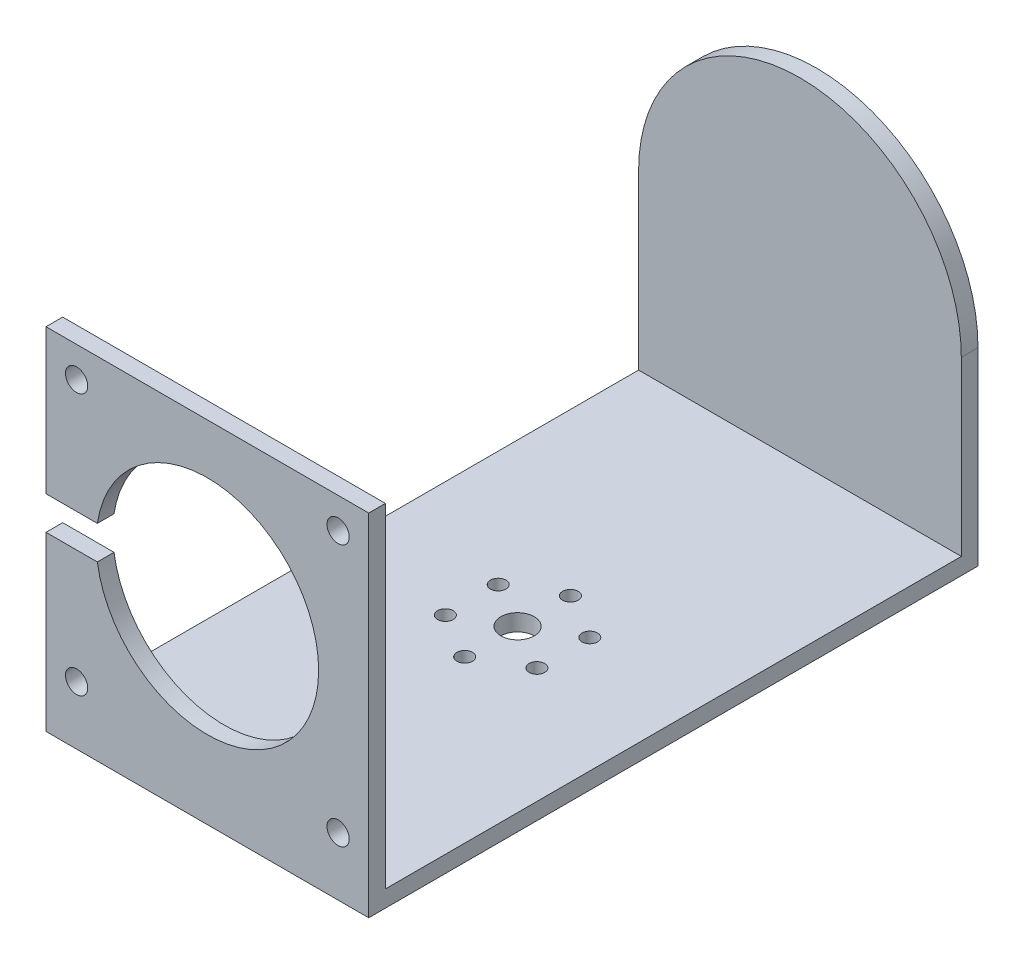
ISO-10303-21;
HEADER;
FILE_DESCRIPTION(('STEP AP214'),'2;1');
FILE_NAME('part.step','',(''),(''),'','','');
FILE_SCHEMA(('AUTOMOTIVE_DESIGN { 1 0 10303 214 1 1 1 1 }'));
ENDSEC;
DATA;
#1=APPLICATION_CONTEXT('core data for automotive mechanical design processes');
#2=APPLICATION_PROTOCOL_DEFINITION('international standard','automotive_design',2000,#1);
#3=PRODUCT_CONTEXT('',#1,'mechanical');
#4=PRODUCT('Part','Part','',(#3));
#5=PRODUCT_RELATED_PRODUCT_CATEGORY('part','',(#4));
#6=PRODUCT_DEFINITION_FORMATION('','',#4);
#7=PRODUCT_DEFINITION_CONTEXT('part definition',#1,'design');
#8=PRODUCT_DEFINITION('design','',#6,#7);
#9=PRODUCT_DEFINITION_SHAPE('','',#8);
#10=(LENGTH_UNIT() NAMED_UNIT(*) SI_UNIT(.MILLI.,.METRE.));
#11=(NAMED_UNIT(*) PLANE_ANGLE_UNIT() SI_UNIT($,.RADIAN.));
#12=(NAMED_UNIT(*) SI_UNIT($,.STERADIAN.) SOLID_ANGLE_UNIT());
#13=UNCERTAINTY_MEASURE_WITH_UNIT(LENGTH_MEASURE(1.E-05),#10,'distance_accuracy_value','');
#14=(GEOMETRIC_REPRESENTATION_CONTEXT(3) GLOBAL_UNCERTAINTY_ASSIGNED_CONTEXT((#13)) GLOBAL_UNIT_ASSIGNED_CONTEXT((#10,
#11,#12)) REPRESENTATION_CONTEXT('',''));
#15=CARTESIAN_POINT('',(0.,0.,0.));
#16=DIRECTION('',(0.,0.,1.));
#17=DIRECTION('',(1.,0.,0.));
#18=AXIS2_PLACEMENT_3D('',#15,#16,#17);
#19=CARTESIAN_POINT('',(0.,0.,0.));
#20=DIRECTION('',(-1.,0.,0.));
#21=DIRECTION('',(0.,0.,1.));
#22=AXIS2_PLACEMENT_3D('',#19,#20,#21);
#23=PLANE('',#22);
#24=DIRECTION('',(0.,0.,1.));
#25=VECTOR('',#24,1.);
#26=CARTESIAN_POINT('',(0.,-1.59919038462656,66.3516718826573));
#27=LINE('',#26,#25);
#28=CARTESIAN_POINT('',(0.,-1.59919038462656,73.3516718826573));
#29=VERTEX_POINT('',#28);
#30=CARTESIAN_POINT('',(0.,-1.59919038462656,76.3516718826573));
#31=VERTEX_POINT('',#30);
#32=EDGE_CURVE('E138',#29,#31,#27,.T.);
#33=ORIENTED_EDGE('',*,*,#32,.F.);
#34=DIRECTION('',(0.,1.,0.));
#35=VECTOR('',#34,1.);
#36=CARTESIAN_POINT('',(0.,30.4008096153734,73.3516718826573));
#37=LINE('',#36,#35);
#38=CARTESIAN_POINT('',(0.,-29.5991903846266,73.3516718826573));
#39=VERTEX_POINT('',#38);
#40=EDGE_CURVE('E159',#39,#29,#37,.T.);
#41=ORIENTED_EDGE('',*,*,#40,.F.);
#42=DIRECTION('',(0.,0.,1.));
#43=VECTOR('',#42,1.);
#44=CARTESIAN_POINT('',(0.,-29.5991903846266,73.3516718826573));
#45=LINE('',#44,#43);
#46=CARTESIAN_POINT('',(0.,-29.5991903846266,-30.1483281173427));
#47=VERTEX_POINT('',#46);
#48=EDGE_CURVE('E157',#47,#39,#45,.T.);
#49=ORIENTED_EDGE('',*,*,#48,.F.);
#50=DIRECTION('',(0.,-1.,0.));
#51=VECTOR('',#50,1.);
#52=CARTESIAN_POINT('',(0.,-29.5991903846266,-30.1483281173427));
#53=LINE('',#52,#51);
#54=CARTESIAN_POINT('',(0.,1.40080961537344,-30.1483281173427));
#55=VERTEX_POINT('',#54);
#56=EDGE_CURVE('E155',#55,#47,#53,.T.);
#57=ORIENTED_EDGE('',*,*,#56,.F.);
#58=DIRECTION('',(0.,0.,-1.));
#59=VECTOR('',#58,1.);
#60=CARTESIAN_POINT('',(0.,1.40080961537344,24.8516718826573));
#61=LINE('',#60,#59);
#62=CARTESIAN_POINT('',(0.,1.40080961537344,-33.1483281173427));
#63=VERTEX_POINT('',#62);
#64=EDGE_CURVE('E203',#63,#55,#61,.F.);
#65=ORIENTED_EDGE('',*,*,#64,.F.);
#66=DIRECTION('',(0.,1.,0.));
#67=VECTOR('',#66,1.);
#68=CARTESIAN_POINT('',(0.,30.4008096153734,-33.1483281173427));
#69=LINE('',#68,#67);
#70=CARTESIAN_POINT('',(0.,-32.5991903846266,-33.1483281173427));
#71=VERTEX_POINT('',#70);
#72=EDGE_CURVE('E147',#71,#63,#69,.T.);
#73=ORIENTED_EDGE('',*,*,#72,.F.);
#74=DIRECTION('',(0.,0.,-1.));
#75=VECTOR('',#74,1.);
#76=CARTESIAN_POINT('',(0.,-32.5991903846266,-33.1483281173427));
#77=LINE('',#76,#75);
#78=CARTESIAN_POINT('',(0.,-32.5991903846266,76.3516718826573));
#79=VERTEX_POINT('',#78);
#80=EDGE_CURVE('E144',#79,#71,#77,.T.);
#81=ORIENTED_EDGE('',*,*,#80,.F.);
#82=DIRECTION('',(0.,-1.,0.));
#83=VECTOR('',#82,1.);
#84=CARTESIAN_POINT('',(0.,-32.5991903846266,76.3516718826573));
#85=LINE('',#84,#83);
#86=EDGE_CURVE('E145',#31,#79,#85,.T.);
#87=ORIENTED_EDGE('',*,*,#86,.F.);
#88=EDGE_LOOP('',(#33,#41,#49,#57,#65,#73,#81,#87));
#89=FACE_BOUND('',#88,.T.);
#90=ADVANCED_FACE('F36',(#89),#23,.T.);
#91=CARTESIAN_POINT('',(58.,30.4008096153734,-33.1483281173427));
#92=DIRECTION('',(0.,0.,1.));
#93=DIRECTION('',(1.,0.,0.));
#94=AXIS2_PLACEMENT_3D('',#91,#92,#93);
#95=PLANE('',#94);
#96=ORIENTED_EDGE('',*,*,#72,.T.);
#97=CARTESIAN_POINT('',(29.,1.40080961537344,-33.1483281173427));
#98=DIRECTION('',(0.,0.,1.));
#99=DIRECTION('',(1.,0.,0.));
#100=AXIS2_PLACEMENT_3D('',#97,#98,#99);
#101=CIRCLE('',#100,29.);
#102=CARTESIAN_POINT('',(58.,1.40080961537344,-33.1483281173427));
#103=VERTEX_POINT('',#102);
#104=EDGE_CURVE('E266',#103,#63,#101,.T.);
#105=ORIENTED_EDGE('',*,*,#104,.F.);
#106=DIRECTION('',(0.,1.,0.));
#107=VECTOR('',#106,1.);
#108=CARTESIAN_POINT('',(58.,30.4008096153734,-33.1483281173427));
#109=LINE('',#108,#107);
#110=CARTESIAN_POINT('',(58.,-32.5991903846266,-33.1483281173427));
#111=VERTEX_POINT('',#110);
#112=EDGE_CURVE('E285',#111,#103,#109,.T.);
#113=ORIENTED_EDGE('',*,*,#112,.F.);
#114=DIRECTION('',(-1.,0.,0.));
#115=VECTOR('',#114,1.);
#116=CARTESIAN_POINT('',(58.,-32.5991903846266,-33.1483281173427));
#117=LINE('',#116,#115);
#118=EDGE_CURVE('E173',#111,#71,#117,.T.);
#119=ORIENTED_EDGE('',*,*,#118,.T.);
#120=EDGE_LOOP('',(#96,#105,#113,#119));
#121=FACE_BOUND('',#120,.T.);
#122=CARTESIAN_POINT('',(29.,1.40080961537344,-33.1483281173427));
#123=DIRECTION('',(0.,0.,1.));
#124=DIRECTION('',(1.,0.,0.));
#125=AXIS2_PLACEMENT_3D('',#122,#123,#124);
#126=CIRCLE('',#125,2.95);
#127=CARTESIAN_POINT('',(31.95,1.40080961537344,-33.1483281173427));
#128=VERTEX_POINT('',#127);
#129=EDGE_CURVE('E206',#128,#128,#126,.F.);
#130=ORIENTED_EDGE('',*,*,#129,.F.);
#131=EDGE_LOOP('',(#130));
#132=FACE_BOUND('',#131,.T.);
#133=ADVANCED_FACE('F300',(#121,#132),#95,.F.);
#134=CARTESIAN_POINT('',(58.,30.4008096153734,76.3516718826573));
#135=DIRECTION('',(0.,-1.,0.));
#136=DIRECTION('',(0.,0.,-1.));
#137=AXIS2_PLACEMENT_3D('',#134,#135,#136);
#138=PLANE('',#137);
#139=DIRECTION('',(0.,0.,1.));
#140=VECTOR('',#139,1.);
#141=CARTESIAN_POINT('',(0.,30.4008096153734,76.3516718826573));
#142=LINE('',#141,#140);
#143=CARTESIAN_POINT('',(0.,30.4008096153734,73.3516718826573));
#144=VERTEX_POINT('',#143);
#145=CARTESIAN_POINT('',(0.,30.4008096153734,76.3516718826573));
#146=VERTEX_POINT('',#145);
#147=EDGE_CURVE('E149',#144,#146,#142,.T.);
#148=ORIENTED_EDGE('',*,*,#147,.T.);
#149=DIRECTION('',(-1.,0.,0.));
#150=VECTOR('',#149,1.);
#151=CARTESIAN_POINT('',(58.,30.4008096153734,76.3516718826573));
#152=LINE('',#151,#150);
#153=CARTESIAN_POINT('',(58.,30.4008096153734,76.3516718826573));
#154=VERTEX_POINT('',#153);
#155=EDGE_CURVE('E142',#154,#146,#152,.T.);
#156=ORIENTED_EDGE('',*,*,#155,.F.);
#157=DIRECTION('',(0.,0.,1.));
#158=VECTOR('',#157,1.);
#159=CARTESIAN_POINT('',(58.,30.4008096153734,76.3516718826573));
#160=LINE('',#159,#158);
#161=CARTESIAN_POINT('',(58.,30.4008096153734,73.3516718826573));
#162=VERTEX_POINT('',#161);
#163=EDGE_CURVE('E162',#162,#154,#160,.T.);
#164=ORIENTED_EDGE('',*,*,#163,.F.);
#165=DIRECTION('',(-1.,0.,0.));
#166=VECTOR('',#165,1.);
#167=CARTESIAN_POINT('',(58.,30.4008096153734,73.3516718826573));
#168=LINE('',#167,#166);
#169=EDGE_CURVE('E163',#162,#144,#168,.T.);
#170=ORIENTED_EDGE('',*,*,#169,.T.);
#171=EDGE_LOOP('',(#148,#156,#164,#170));
#172=FACE_BOUND('',#171,.T.);
#173=ADVANCED_FACE('F38',(#172),#138,.F.);
#174=CARTESIAN_POINT('',(58.,-32.5991903846266,76.3516718826573));
#175=DIRECTION('',(0.,0.,-1.));
#176=DIRECTION('',(-1.,0.,0.));
#177=AXIS2_PLACEMENT_3D('',#174,#175,#176);
#178=PLANE('',#177);
#179=CARTESIAN_POINT('',(5.50000000000003,-22.0991903846266,76.3516718826573));
#180=DIRECTION('',(0.,0.,1.));
#181=DIRECTION('',(-1.,0.,0.));
#182=AXIS2_PLACEMENT_3D('',#179,#180,#181);
#183=CIRCLE('',#182,2.);
#184=CARTESIAN_POINT('',(3.50000000000003,-22.0991903846266,76.3516718826573));
#185=VERTEX_POINT('',#184);
#186=EDGE_CURVE('E196',#185,#185,#183,.T.);
#187=ORIENTED_EDGE('',*,*,#186,.F.);
#188=EDGE_LOOP('',(#187));
#189=FACE_BOUND('',#188,.T.);
#190=CARTESIAN_POINT('',(52.5,-22.0991903846266,76.3516718826573));
#191=DIRECTION('',(0.,0.,1.));
#192=DIRECTION('',(1.,0.,0.));
#193=AXIS2_PLACEMENT_3D('',#190,#191,#192);
#194=CIRCLE('',#193,2.);
#195=CARTESIAN_POINT('',(54.5,-22.0991903846266,76.3516718826573));
#196=VERTEX_POINT('',#195);
#197=EDGE_CURVE('E192',#196,#196,#194,.T.);
#198=ORIENTED_EDGE('',*,*,#197,.F.);
#199=EDGE_LOOP('',(#198));
#200=FACE_BOUND('',#199,.T.);
#201=CARTESIAN_POINT('',(52.5,24.9008096153734,76.3516718826573));
#202=DIRECTION('',(0.,0.,1.));
#203=DIRECTION('',(-1.,0.,0.));
#204=AXIS2_PLACEMENT_3D('',#201,#202,#203);
#205=CIRCLE('',#204,2.);
#206=CARTESIAN_POINT('',(50.5,24.9008096153734,76.3516718826573));
#207=VERTEX_POINT('',#206);
#208=EDGE_CURVE('E188',#207,#207,#205,.T.);
#209=ORIENTED_EDGE('',*,*,#208,.F.);
#210=EDGE_LOOP('',(#209));
#211=FACE_BOUND('',#210,.T.);
#212=CARTESIAN_POINT('',(5.5,24.9008096153734,76.3516718826573));
#213=DIRECTION('',(0.,0.,1.));
#214=DIRECTION('',(1.,0.,0.));
#215=AXIS2_PLACEMENT_3D('',#212,#213,#214);
#216=CIRCLE('',#215,2.);
#217=CARTESIAN_POINT('',(7.5,24.9008096153734,76.3516718826573));
#218=VERTEX_POINT('',#217);
#219=EDGE_CURVE('E184',#218,#218,#216,.T.);
#220=ORIENTED_EDGE('',*,*,#219,.F.);
#221=EDGE_LOOP('',(#220));
#222=FACE_BOUND('',#221,.T.);
#223=CARTESIAN_POINT('',(29.,1.40080961537344,76.3516718826573));
#224=DIRECTION('',(0.,0.,1.));
#225=DIRECTION('',(1.,0.,0.));
#226=AXIS2_PLACEMENT_3D('',#223,#224,#225);
#227=CIRCLE('',#226,20.);
#228=CARTESIAN_POINT('',(9.22628006671481,-1.59919038462656,76.3516718826573));
#229=VERTEX_POINT('',#228);
#230=CARTESIAN_POINT('',(9.22628006671481,4.40080961537344,76.3516718826573));
#231=VERTEX_POINT('',#230);
#232=EDGE_CURVE('E200',#229,#231,#227,.T.);
#233=ORIENTED_EDGE('',*,*,#232,.F.);
#234=DIRECTION('',(1.,0.,0.));
#235=VECTOR('',#234,1.);
#236=CARTESIAN_POINT('',(29.,-1.59919038462656,76.3516718826573));
#237=LINE('',#236,#235);
#238=EDGE_CURVE('E59',#31,#229,#237,.T.);
#239=ORIENTED_EDGE('',*,*,#238,.F.);
#240=ORIENTED_EDGE('',*,*,#86,.T.);
#241=DIRECTION('',(-1.,0.,0.));
#242=VECTOR('',#241,1.);
#243=CARTESIAN_POINT('',(58.,-32.5991903846266,76.3516718826573));
#244=LINE('',#243,#242);
#245=CARTESIAN_POINT('',(58.,-32.5991903846266,76.3516718826573));
#246=VERTEX_POINT('',#245);
#247=EDGE_CURVE('E176',#246,#79,#244,.T.);
#248=ORIENTED_EDGE('',*,*,#247,.F.);
#249=DIRECTION('',(0.,-1.,0.));
#250=VECTOR('',#249,1.);
#251=CARTESIAN_POINT('',(58.,-32.5991903846266,76.3516718826573));
#252=LINE('',#251,#250);
#253=EDGE_CURVE('E281',#154,#246,#252,.T.);
#254=ORIENTED_EDGE('',*,*,#253,.F.);
#255=ORIENTED_EDGE('',*,*,#155,.T.);
#256=CARTESIAN_POINT('',(0.,4.40080961537344,76.3516718826573));
#257=VERTEX_POINT('',#256);
#258=EDGE_CURVE('E135',#146,#257,#85,.T.);
#259=ORIENTED_EDGE('',*,*,#258,.T.);
#260=DIRECTION('',(-1.,0.,0.));
#261=VECTOR('',#260,1.);
#262=CARTESIAN_POINT('',(29.,4.40080961537344,76.3516718826573));
#263=LINE('',#262,#261);
#264=EDGE_CURVE('E122',#231,#257,#263,.T.);
#265=ORIENTED_EDGE('',*,*,#264,.F.);
#266=EDGE_LOOP('',(#233,#239,#240,#248,#254,#255,#259,#265));
#267=FACE_BOUND('',#266,.T.);
#268=ADVANCED_FACE('F140',(#189,#200,#211,#222,#267),#178,.F.);
#269=CARTESIAN_POINT('',(58.,-32.5991903846266,-33.1483281173427));
#270=DIRECTION('',(0.,1.,0.));
#271=DIRECTION('',(0.,0.,1.));
#272=AXIS2_PLACEMENT_3D('',#269,#270,#271);
#273=PLANE('',#272);
#274=CARTESIAN_POINT('',(20.7727586640481,-32.5991903846266,25.3516718826571));
#275=DIRECTION('',(0.,-1.,0.));
#276=DIRECTION('',(0.,0.,-1.));
#277=AXIS2_PLACEMENT_3D('',#274,#275,#276);
#278=CIRCLE('',#277,1.39999999999999);
#279=CARTESIAN_POINT('',(20.7727586640481,-32.5991903846266,23.9516718826571));
#280=VERTEX_POINT('',#279);
#281=EDGE_CURVE('E236',#280,#280,#278,.T.);
#282=ORIENTED_EDGE('',*,*,#281,.F.);
#283=EDGE_LOOP('',(#282));
#284=FACE_BOUND('',#283,.T.);
#285=CARTESIAN_POINT('',(20.7727586640484,-32.5991903846266,15.851671882657));
#286=DIRECTION('',(0.,-1.,0.));
#287=DIRECTION('',(0.,0.,-1.));
#288=AXIS2_PLACEMENT_3D('',#285,#286,#287);
#289=CIRCLE('',#288,1.4);
#290=CARTESIAN_POINT('',(20.7727586640484,-32.5991903846266,14.451671882657));
#291=VERTEX_POINT('',#290);
#292=EDGE_CURVE('E233',#291,#291,#289,.T.);
#293=ORIENTED_EDGE('',*,*,#292,.F.);
#294=EDGE_LOOP('',(#293));
#295=FACE_BOUND('',#294,.T.);
#296=CARTESIAN_POINT('',(29.0000000000007,-32.5991903846266,11.1016718826573));
#297=DIRECTION('',(0.,-1.,0.));
#298=DIRECTION('',(0.,0.,-1.));
#299=AXIS2_PLACEMENT_3D('',#296,#297,#298);
#300=CIRCLE('',#299,1.4);
#301=CARTESIAN_POINT('',(29.0000000000007,-32.5991903846266,9.70167188265729));
#302=VERTEX_POINT('',#301);
#303=EDGE_CURVE('E229',#302,#302,#300,.T.);
#304=ORIENTED_EDGE('',*,*,#303,.F.);
#305=EDGE_LOOP('',(#304));
#306=FACE_BOUND('',#305,.T.);
#307=CARTESIAN_POINT('',(37.2272413359527,-32.5991903846266,15.8516718826576));
#308=DIRECTION('',(0.,-1.,0.));
#309=DIRECTION('',(0.,0.,-1.));
#310=AXIS2_PLACEMENT_3D('',#307,#308,#309);
#311=CIRCLE('',#310,1.40000000000001);
#312=CARTESIAN_POINT('',(37.2272413359527,-32.5991903846266,14.4516718826576));
#313=VERTEX_POINT('',#312);
#314=EDGE_CURVE('E225',#313,#313,#311,.T.);
#315=ORIENTED_EDGE('',*,*,#314,.F.);
#316=EDGE_LOOP('',(#315));
#317=FACE_BOUND('',#316,.T.);
#318=CARTESIAN_POINT('',(37.2272413359524,-32.5991903846266,25.3516718826576));
#319=DIRECTION('',(0.,-1.,0.));
#320=DIRECTION('',(0.,0.,-1.));
#321=AXIS2_PLACEMENT_3D('',#318,#319,#320);
#322=CIRCLE('',#321,1.4);
#323=CARTESIAN_POINT('',(37.2272413359524,-32.5991903846266,23.9516718826576));
#324=VERTEX_POINT('',#323);
#325=EDGE_CURVE('E221',#324,#324,#322,.T.);
#326=ORIENTED_EDGE('',*,*,#325,.F.);
#327=EDGE_LOOP('',(#326));
#328=FACE_BOUND('',#327,.T.);
#329=CARTESIAN_POINT('',(29.,-32.5991903846266,30.1016718826573));
#330=DIRECTION('',(0.,-1.,0.));
#331=DIRECTION('',(0.,0.,-1.));
#332=AXIS2_PLACEMENT_3D('',#329,#330,#331);
#333=CIRCLE('',#332,1.4);
#334=CARTESIAN_POINT('',(29.,-32.5991903846266,28.7016718826573));
#335=VERTEX_POINT('',#334);
#336=EDGE_CURVE('E217',#335,#335,#333,.T.);
#337=ORIENTED_EDGE('',*,*,#336,.F.);
#338=EDGE_LOOP('',(#337));
#339=FACE_BOUND('',#338,.T.);
#340=CARTESIAN_POINT('',(29.,-32.5991903846266,20.6016718826573));
#341=DIRECTION('',(0.,-1.,0.));
#342=DIRECTION('',(0.,0.,-1.));
#343=AXIS2_PLACEMENT_3D('',#340,#341,#342);
#344=CIRCLE('',#343,3.);
#345=CARTESIAN_POINT('',(29.,-32.5991903846266,17.6016718826573));
#346=VERTEX_POINT('',#345);
#347=EDGE_CURVE('E213',#346,#346,#344,.T.);
#348=ORIENTED_EDGE('',*,*,#347,.F.);
#349=EDGE_LOOP('',(#348));
#350=FACE_BOUND('',#349,.T.);
#351=ORIENTED_EDGE('',*,*,#80,.T.);
#352=ORIENTED_EDGE('',*,*,#118,.F.);
#353=DIRECTION('',(0.,0.,-1.));
#354=VECTOR('',#353,1.);
#355=CARTESIAN_POINT('',(58.,-32.5991903846266,-33.1483281173427));
#356=LINE('',#355,#354);
#357=EDGE_CURVE('E283',#246,#111,#356,.T.);
#358=ORIENTED_EDGE('',*,*,#357,.F.);
#359=ORIENTED_EDGE('',*,*,#247,.T.);
#360=EDGE_LOOP('',(#351,#352,#358,#359));
#361=FACE_BOUND('',#360,.T.);
#362=ADVANCED_FACE('F305',(#284,#295,#306,#317,#328,#339,#350,#361),#273,.F.);
#363=CARTESIAN_POINT('',(58.,-29.5991903846266,-30.1483281173427));
#364=DIRECTION('',(0.,0.,-1.));
#365=DIRECTION('',(-1.,0.,0.));
#366=AXIS2_PLACEMENT_3D('',#363,#364,#365);
#367=PLANE('',#366);
#368=CARTESIAN_POINT('',(29.,1.40080961537344,-30.1483281173427));
#369=DIRECTION('',(0.,0.,-1.));
#370=DIRECTION('',(-1.,0.,0.));
#371=AXIS2_PLACEMENT_3D('',#368,#369,#370);
#372=CIRCLE('',#371,29.);
#373=CARTESIAN_POINT('',(58.,1.40080961537344,-30.1483281173427));
#374=VERTEX_POINT('',#373);
#375=EDGE_CURVE('E268',#374,#55,#372,.F.);
#376=ORIENTED_EDGE('',*,*,#375,.T.);
#377=ORIENTED_EDGE('',*,*,#56,.T.);
#378=DIRECTION('',(-1.,0.,0.));
#379=VECTOR('',#378,1.);
#380=CARTESIAN_POINT('',(58.,-29.5991903846266,-30.1483281173427));
#381=LINE('',#380,#379);
#382=CARTESIAN_POINT('',(58.,-29.5991903846266,-30.1483281173427));
#383=VERTEX_POINT('',#382);
#384=EDGE_CURVE('E170',#383,#47,#381,.T.);
#385=ORIENTED_EDGE('',*,*,#384,.F.);
#386=DIRECTION('',(0.,-1.,0.));
#387=VECTOR('',#386,1.);
#388=CARTESIAN_POINT('',(58.,-29.5991903846266,-30.1483281173427));
#389=LINE('',#388,#387);
#390=EDGE_CURVE('E288',#374,#383,#389,.T.);
#391=ORIENTED_EDGE('',*,*,#390,.F.);
#392=EDGE_LOOP('',(#376,#377,#385,#391));
#393=FACE_BOUND('',#392,.T.);
#394=ADVANCED_FACE('F405',(#393),#367,.F.);
#395=CARTESIAN_POINT('',(58.,-29.5991903846266,73.3516718826573));
#396=DIRECTION('',(0.,-1.,0.));
#397=DIRECTION('',(0.,0.,-1.));
#398=AXIS2_PLACEMENT_3D('',#395,#396,#397);
#399=PLANE('',#398);
#400=CARTESIAN_POINT('',(20.7727586640481,-29.5991903846266,25.3516718826571));
#401=DIRECTION('',(0.,-1.,0.));
#402=DIRECTION('',(0.,0.,-1.));
#403=AXIS2_PLACEMENT_3D('',#400,#401,#402);
#404=CIRCLE('',#403,1.39999999999999);
#405=CARTESIAN_POINT('',(20.7727586640481,-29.5991903846266,23.9516718826571));
#406=VERTEX_POINT('',#405);
#407=EDGE_CURVE('E234',#406,#406,#404,.T.);
#408=ORIENTED_EDGE('',*,*,#407,.T.);
#409=EDGE_LOOP('',(#408));
#410=FACE_BOUND('',#409,.T.);
#411=CARTESIAN_POINT('',(20.7727586640484,-29.5991903846266,15.851671882657));
#412=DIRECTION('',(0.,-1.,0.));
#413=DIRECTION('',(0.,0.,-1.));
#414=AXIS2_PLACEMENT_3D('',#411,#412,#413);
#415=CIRCLE('',#414,1.4);
#416=CARTESIAN_POINT('',(20.7727586640484,-29.5991903846266,14.451671882657));
#417=VERTEX_POINT('',#416);
#418=EDGE_CURVE('E230',#417,#417,#415,.T.);
#419=ORIENTED_EDGE('',*,*,#418,.T.);
#420=EDGE_LOOP('',(#419));
#421=FACE_BOUND('',#420,.T.);
#422=CARTESIAN_POINT('',(29.0000000000007,-29.5991903846266,11.1016718826573));
#423=DIRECTION('',(0.,-1.,0.));
#424=DIRECTION('',(0.,0.,-1.));
#425=AXIS2_PLACEMENT_3D('',#422,#423,#424);
#426=CIRCLE('',#425,1.4);
#427=CARTESIAN_POINT('',(29.0000000000007,-29.5991903846266,9.70167188265729));
#428=VERTEX_POINT('',#427);
#429=EDGE_CURVE('E226',#428,#428,#426,.T.);
#430=ORIENTED_EDGE('',*,*,#429,.T.);
#431=EDGE_LOOP('',(#430));
#432=FACE_BOUND('',#431,.T.);
#433=CARTESIAN_POINT('',(37.2272413359527,-29.5991903846266,15.8516718826576));
#434=DIRECTION('',(0.,-1.,0.));
#435=DIRECTION('',(0.,0.,-1.));
#436=AXIS2_PLACEMENT_3D('',#433,#434,#435);
#437=CIRCLE('',#436,1.40000000000001);
#438=CARTESIAN_POINT('',(37.2272413359527,-29.5991903846266,14.4516718826576));
#439=VERTEX_POINT('',#438);
#440=EDGE_CURVE('E222',#439,#439,#437,.T.);
#441=ORIENTED_EDGE('',*,*,#440,.T.);
#442=EDGE_LOOP('',(#441));
#443=FACE_BOUND('',#442,.T.);
#444=CARTESIAN_POINT('',(37.2272413359524,-29.5991903846266,25.3516718826576));
#445=DIRECTION('',(0.,-1.,0.));
#446=DIRECTION('',(0.,0.,-1.));
#447=AXIS2_PLACEMENT_3D('',#444,#445,#446);
#448=CIRCLE('',#447,1.4);
#449=CARTESIAN_POINT('',(37.2272413359524,-29.5991903846266,23.9516718826576));
#450=VERTEX_POINT('',#449);
#451=EDGE_CURVE('E218',#450,#450,#448,.T.);
#452=ORIENTED_EDGE('',*,*,#451,.T.);
#453=EDGE_LOOP('',(#452));
#454=FACE_BOUND('',#453,.T.);
#455=CARTESIAN_POINT('',(29.,-29.5991903846266,30.1016718826573));
#456=DIRECTION('',(0.,-1.,0.));
#457=DIRECTION('',(0.,0.,-1.));
#458=AXIS2_PLACEMENT_3D('',#455,#456,#457);
#459=CIRCLE('',#458,1.4);
#460=CARTESIAN_POINT('',(29.,-29.5991903846266,28.7016718826573));
#461=VERTEX_POINT('',#460);
#462=EDGE_CURVE('E214',#461,#461,#459,.T.);
#463=ORIENTED_EDGE('',*,*,#462,.T.);
#464=EDGE_LOOP('',(#463));
#465=FACE_BOUND('',#464,.T.);
#466=CARTESIAN_POINT('',(29.,-29.5991903846266,20.6016718826573));
#467=DIRECTION('',(0.,-1.,0.));
#468=DIRECTION('',(0.,0.,-1.));
#469=AXIS2_PLACEMENT_3D('',#466,#467,#468);
#470=CIRCLE('',#469,3.);
#471=CARTESIAN_POINT('',(29.,-29.5991903846266,17.6016718826573));
#472=VERTEX_POINT('',#471);
#473=EDGE_CURVE('E209',#472,#472,#470,.T.);
#474=ORIENTED_EDGE('',*,*,#473,.T.);
#475=EDGE_LOOP('',(#474));
#476=FACE_BOUND('',#475,.T.);
#477=ORIENTED_EDGE('',*,*,#48,.T.);
#478=DIRECTION('',(-1.,0.,0.));
#479=VECTOR('',#478,1.);
#480=CARTESIAN_POINT('',(58.,-29.5991903846266,73.3516718826573));
#481=LINE('',#480,#479);
#482=CARTESIAN_POINT('',(58.,-29.5991903846266,73.3516718826573));
#483=VERTEX_POINT('',#482);
#484=EDGE_CURVE('E166',#483,#39,#481,.T.);
#485=ORIENTED_EDGE('',*,*,#484,.F.);
#486=DIRECTION('',(0.,0.,1.));
#487=VECTOR('',#486,1.);
#488=CARTESIAN_POINT('',(58.,-29.5991903846266,73.3516718826573));
#489=LINE('',#488,#487);
#490=EDGE_CURVE('E290',#383,#483,#489,.T.);
#491=ORIENTED_EDGE('',*,*,#490,.F.);
#492=ORIENTED_EDGE('',*,*,#384,.T.);
#493=EDGE_LOOP('',(#477,#485,#491,#492));
#494=FACE_BOUND('',#493,.T.);
#495=ADVANCED_FACE('F328',(#410,#421,#432,#443,#454,#465,#476,#494),#399,.F.);
#496=CARTESIAN_POINT('',(58.,30.4008096153734,73.3516718826573));
#497=DIRECTION('',(0.,0.,1.));
#498=DIRECTION('',(0.,-1.,0.));
#499=AXIS2_PLACEMENT_3D('',#496,#497,#498);
#500=PLANE('',#499);
#501=ORIENTED_EDGE('',*,*,#40,.T.);
#502=DIRECTION('',(1.,0.,0.));
#503=VECTOR('',#502,1.);
#504=CARTESIAN_POINT('',(58.,-1.59919038462656,73.3516718826573));
#505=LINE('',#504,#503);
#506=CARTESIAN_POINT('',(9.22628006671482,-1.59919038462656,73.3516718826573));
#507=VERTEX_POINT('',#506);
#508=EDGE_CURVE('E244',#29,#507,#505,.T.);
#509=ORIENTED_EDGE('',*,*,#508,.T.);
#510=CARTESIAN_POINT('',(29.,1.40080961537344,73.3516718826573));
#511=DIRECTION('',(0.,0.,1.));
#512=DIRECTION('',(0.,-1.,0.));
#513=AXIS2_PLACEMENT_3D('',#510,#511,#512);
#514=CIRCLE('',#513,20.);
#515=CARTESIAN_POINT('',(9.22628006671481,4.40080961537344,73.3516718826573));
#516=VERTEX_POINT('',#515);
#517=EDGE_CURVE('E197',#507,#516,#514,.T.);
#518=ORIENTED_EDGE('',*,*,#517,.T.);
#519=DIRECTION('',(-1.,0.,0.));
#520=VECTOR('',#519,1.);
#521=CARTESIAN_POINT('',(58.,4.40080961537344,73.3516718826573));
#522=LINE('',#521,#520);
#523=CARTESIAN_POINT('',(0.,4.40080961537344,73.3516718826573));
#524=VERTEX_POINT('',#523);
#525=EDGE_CURVE('E51',#516,#524,#522,.T.);
#526=ORIENTED_EDGE('',*,*,#525,.T.);
#527=EDGE_CURVE('E137',#524,#144,#37,.T.);
#528=ORIENTED_EDGE('',*,*,#527,.T.);
#529=ORIENTED_EDGE('',*,*,#169,.F.);
#530=DIRECTION('',(0.,1.,0.));
#531=VECTOR('',#530,1.);
#532=CARTESIAN_POINT('',(58.,30.4008096153734,73.3516718826573));
#533=LINE('',#532,#531);
#534=EDGE_CURVE('E167',#483,#162,#533,.T.);
#535=ORIENTED_EDGE('',*,*,#534,.F.);
#536=ORIENTED_EDGE('',*,*,#484,.T.);
#537=EDGE_LOOP('',(#501,#509,#518,#526,#528,#529,#535,#536));
#538=FACE_BOUND('',#537,.T.);
#539=CARTESIAN_POINT('',(5.50000000000003,-22.0991903846266,73.3516718826573));
#540=DIRECTION('',(0.,0.,1.));
#541=DIRECTION('',(0.,-1.,0.));
#542=AXIS2_PLACEMENT_3D('',#539,#540,#541);
#543=CIRCLE('',#542,2.);
#544=CARTESIAN_POINT('',(5.50000000000003,-24.0991903846266,73.3516718826573));
#545=VERTEX_POINT('',#544);
#546=EDGE_CURVE('E193',#545,#545,#543,.T.);
#547=ORIENTED_EDGE('',*,*,#546,.T.);
#548=EDGE_LOOP('',(#547));
#549=FACE_BOUND('',#548,.T.);
#550=CARTESIAN_POINT('',(52.5,-22.0991903846266,73.3516718826573));
#551=DIRECTION('',(0.,0.,1.));
#552=DIRECTION('',(0.,-1.,0.));
#553=AXIS2_PLACEMENT_3D('',#550,#551,#552);
#554=CIRCLE('',#553,2.);
#555=CARTESIAN_POINT('',(52.5,-24.0991903846266,73.3516718826573));
#556=VERTEX_POINT('',#555);
#557=EDGE_CURVE('E189',#556,#556,#554,.T.);
#558=ORIENTED_EDGE('',*,*,#557,.T.);
#559=EDGE_LOOP('',(#558));
#560=FACE_BOUND('',#559,.T.);
#561=CARTESIAN_POINT('',(52.5,24.9008096153734,73.3516718826573));
#562=DIRECTION('',(0.,0.,1.));
#563=DIRECTION('',(0.,-1.,0.));
#564=AXIS2_PLACEMENT_3D('',#561,#562,#563);
#565=CIRCLE('',#564,2.);
#566=CARTESIAN_POINT('',(52.5,22.9008096153734,73.3516718826573));
#567=VERTEX_POINT('',#566);
#568=EDGE_CURVE('E185',#567,#567,#565,.T.);
#569=ORIENTED_EDGE('',*,*,#568,.T.);
#570=EDGE_LOOP('',(#569));
#571=FACE_BOUND('',#570,.T.);
#572=CARTESIAN_POINT('',(5.5,24.9008096153734,73.3516718826573));
#573=DIRECTION('',(0.,0.,1.));
#574=DIRECTION('',(0.,-1.,0.));
#575=AXIS2_PLACEMENT_3D('',#572,#573,#574);
#576=CIRCLE('',#575,2.);
#577=CARTESIAN_POINT('',(5.5,22.9008096153734,73.3516718826573));
#578=VERTEX_POINT('',#577);
#579=EDGE_CURVE('E181',#578,#578,#576,.T.);
#580=ORIENTED_EDGE('',*,*,#579,.T.);
#581=EDGE_LOOP('',(#580));
#582=FACE_BOUND('',#581,.T.);
#583=ADVANCED_FACE('F242',(#538,#549,#560,#571,#582),#500,.F.);
#584=CARTESIAN_POINT('',(58.,0.,0.));
#585=DIRECTION('',(-1.,0.,0.));
#586=DIRECTION('',(0.,0.,1.));
#587=AXIS2_PLACEMENT_3D('',#584,#585,#586);
#588=PLANE('',#587);
#589=ORIENTED_EDGE('',*,*,#112,.T.);
#590=DIRECTION('',(0.,0.,-1.));
#591=VECTOR('',#590,1.);
#592=CARTESIAN_POINT('',(58.,1.40080961537344,24.8516718826573));
#593=LINE('',#592,#591);
#594=EDGE_CURVE('E180',#103,#374,#593,.F.);
#595=ORIENTED_EDGE('',*,*,#594,.T.);
#596=ORIENTED_EDGE('',*,*,#390,.T.);
#597=ORIENTED_EDGE('',*,*,#490,.T.);
#598=ORIENTED_EDGE('',*,*,#534,.T.);
#599=ORIENTED_EDGE('',*,*,#163,.T.);
#600=ORIENTED_EDGE('',*,*,#253,.T.);
#601=ORIENTED_EDGE('',*,*,#357,.T.);
#602=EDGE_LOOP('',(#589,#595,#596,#597,#598,#599,#600,#601));
#603=FACE_BOUND('',#602,.T.);
#604=ADVANCED_FACE('F294',(#603),#588,.F.);
#605=DIRECTION('',(0.,0.,1.));
#606=VECTOR('',#605,1.);
#607=CARTESIAN_POINT('',(0.,4.40080961537344,66.3516718826573));
#608=LINE('',#607,#606);
#609=EDGE_CURVE('E125',#524,#257,#608,.T.);
#610=ORIENTED_EDGE('',*,*,#609,.T.);
#611=ORIENTED_EDGE('',*,*,#258,.F.);
#612=ORIENTED_EDGE('',*,*,#147,.F.);
#613=ORIENTED_EDGE('',*,*,#527,.F.);
#614=EDGE_LOOP('',(#610,#611,#612,#613));
#615=FACE_BOUND('',#614,.T.);
#616=ADVANCED_FACE('F133',(#615),#23,.T.);
#617=CARTESIAN_POINT('',(5.5,24.9008096153734,18.3516718826573));
#618=DIRECTION('',(0.,0.,1.));
#619=DIRECTION('',(1.,0.,0.));
#620=AXIS2_PLACEMENT_3D('',#617,#618,#619);
#621=CYLINDRICAL_SURFACE('',#620,2.);
#622=ORIENTED_EDGE('',*,*,#219,.T.);
#623=EDGE_LOOP('',(#622));
#624=FACE_BOUND('',#623,.T.);
#625=ORIENTED_EDGE('',*,*,#579,.F.);
#626=EDGE_LOOP('',(#625));
#627=FACE_BOUND('',#626,.T.);
#628=ADVANCED_FACE('F317',(#624,#627),#621,.F.);
#629=CARTESIAN_POINT('',(52.5,24.9008096153734,18.3516718826573));
#630=DIRECTION('',(0.,0.,1.));
#631=DIRECTION('',(1.,0.,0.));
#632=AXIS2_PLACEMENT_3D('',#629,#630,#631);
#633=CYLINDRICAL_SURFACE('',#632,2.);
#634=ORIENTED_EDGE('',*,*,#208,.T.);
#635=EDGE_LOOP('',(#634));
#636=FACE_BOUND('',#635,.T.);
#637=ORIENTED_EDGE('',*,*,#568,.F.);
#638=EDGE_LOOP('',(#637));
#639=FACE_BOUND('',#638,.T.);
#640=ADVANCED_FACE('F322',(#636,#639),#633,.F.);
#641=CARTESIAN_POINT('',(52.5,-22.0991903846266,18.3516718826573));
#642=DIRECTION('',(0.,0.,1.));
#643=DIRECTION('',(1.,0.,0.));
#644=AXIS2_PLACEMENT_3D('',#641,#642,#643);
#645=CYLINDRICAL_SURFACE('',#644,2.);
#646=ORIENTED_EDGE('',*,*,#197,.T.);
#647=EDGE_LOOP('',(#646));
#648=FACE_BOUND('',#647,.T.);
#649=ORIENTED_EDGE('',*,*,#557,.F.);
#650=EDGE_LOOP('',(#649));
#651=FACE_BOUND('',#650,.T.);
#652=ADVANCED_FACE('F332',(#648,#651),#645,.F.);
#653=CARTESIAN_POINT('',(5.50000000000003,-22.0991903846266,18.3516718826573));
#654=DIRECTION('',(0.,0.,1.));
#655=DIRECTION('',(1.,0.,0.));
#656=AXIS2_PLACEMENT_3D('',#653,#654,#655);
#657=CYLINDRICAL_SURFACE('',#656,2.);
#658=ORIENTED_EDGE('',*,*,#186,.T.);
#659=EDGE_LOOP('',(#658));
#660=FACE_BOUND('',#659,.T.);
#661=ORIENTED_EDGE('',*,*,#546,.F.);
#662=EDGE_LOOP('',(#661));
#663=FACE_BOUND('',#662,.T.);
#664=ADVANCED_FACE('F336',(#660,#663),#657,.F.);
#665=CARTESIAN_POINT('',(29.,1.40080961537344,18.3516718826573));
#666=DIRECTION('',(0.,0.,1.));
#667=DIRECTION('',(1.,0.,0.));
#668=AXIS2_PLACEMENT_3D('',#665,#666,#667);
#669=CYLINDRICAL_SURFACE('',#668,20.);
#670=ORIENTED_EDGE('',*,*,#517,.F.);
#671=DIRECTION('',(0.,0.,1.));
#672=VECTOR('',#671,1.);
#673=CARTESIAN_POINT('',(9.22628006671482,-1.59919038462656,18.3516718826573));
#674=LINE('',#673,#672);
#675=EDGE_CURVE('E11',#507,#229,#674,.T.);
#676=ORIENTED_EDGE('',*,*,#675,.T.);
#677=ORIENTED_EDGE('',*,*,#232,.T.);
#678=DIRECTION('',(0.,0.,1.));
#679=VECTOR('',#678,1.);
#680=CARTESIAN_POINT('',(9.22628006671482,4.40080961537344,18.3516718826573));
#681=LINE('',#680,#679);
#682=EDGE_CURVE('E44',#231,#516,#681,.F.);
#683=ORIENTED_EDGE('',*,*,#682,.T.);
#684=EDGE_LOOP('',(#670,#676,#677,#683));
#685=FACE_BOUND('',#684,.T.);
#686=ADVANCED_FACE('F239',(#685),#669,.F.);
#687=CARTESIAN_POINT('',(29.,1.40080961537344,24.8516718826573));
#688=DIRECTION('',(0.,0.,-1.));
#689=DIRECTION('',(-1.,0.,0.));
#690=AXIS2_PLACEMENT_3D('',#687,#688,#689);
#691=CYLINDRICAL_SURFACE('',#690,29.);
#692=ORIENTED_EDGE('',*,*,#594,.F.);
#693=ORIENTED_EDGE('',*,*,#104,.T.);
#694=ORIENTED_EDGE('',*,*,#64,.T.);
#695=ORIENTED_EDGE('',*,*,#375,.F.);
#696=EDGE_LOOP('',(#692,#693,#694,#695));
#697=FACE_BOUND('',#696,.T.);
#698=ADVANCED_FACE('F343',(#697),#691,.T.);
#699=CARTESIAN_POINT('',(29.,1.40080961537344,-41.1483281173427));
#700=DIRECTION('',(0.,0.,1.));
#701=DIRECTION('',(1.,0.,0.));
#702=AXIS2_PLACEMENT_3D('',#699,#700,#701);
#703=CYLINDRICAL_SURFACE('',#702,2.95);
#704=CARTESIAN_POINT('',(29.,1.40080961537344,-41.1483281173427));
#705=DIRECTION('',(0.,0.,-1.));
#706=DIRECTION('',(-1.,0.,0.));
#707=AXIS2_PLACEMENT_3D('',#704,#705,#706);
#708=CIRCLE('',#707,2.95);
#709=CARTESIAN_POINT('',(26.05,1.40080961537344,-41.1483281173427));
#710=VERTEX_POINT('',#709);
#711=EDGE_CURVE('E212',#710,#710,#708,.T.);
#712=ORIENTED_EDGE('',*,*,#711,.F.);
#713=EDGE_LOOP('',(#712));
#714=FACE_BOUND('',#713,.T.);
#715=ORIENTED_EDGE('',*,*,#129,.T.);
#716=EDGE_LOOP('',(#715));
#717=FACE_BOUND('',#716,.T.);
#718=ADVANCED_FACE('F346',(#714,#717),#703,.T.);
#719=CARTESIAN_POINT('',(29.,1.40080961537344,-41.1483281173427));
#720=DIRECTION('',(0.,0.,-1.));
#721=DIRECTION('',(-1.,0.,0.));
#722=AXIS2_PLACEMENT_3D('',#719,#720,#721);
#723=PLANE('',#722);
#724=ORIENTED_EDGE('',*,*,#711,.T.);
#725=EDGE_LOOP('',(#724));
#726=FACE_BOUND('',#725,.T.);
#727=ADVANCED_FACE('F350',(#726),#723,.T.);
#728=CARTESIAN_POINT('',(29.,-24.5991903846266,20.6016718826573));
#729=DIRECTION('',(0.,-1.,0.));
#730=DIRECTION('',(0.,0.,-1.));
#731=AXIS2_PLACEMENT_3D('',#728,#729,#730);
#732=CYLINDRICAL_SURFACE('',#731,3.);
#733=ORIENTED_EDGE('',*,*,#347,.T.);
#734=EDGE_LOOP('',(#733));
#735=FACE_BOUND('',#734,.T.);
#736=ORIENTED_EDGE('',*,*,#473,.F.);
#737=EDGE_LOOP('',(#736));
#738=FACE_BOUND('',#737,.T.);
#739=ADVANCED_FACE('F354',(#735,#738),#732,.F.);
#740=CARTESIAN_POINT('',(29.,-24.5991903846266,30.1016718826573));
#741=DIRECTION('',(0.,-1.,0.));
#742=DIRECTION('',(0.,0.,-1.));
#743=AXIS2_PLACEMENT_3D('',#740,#741,#742);
#744=CYLINDRICAL_SURFACE('',#743,1.4);
#745=ORIENTED_EDGE('',*,*,#336,.T.);
#746=EDGE_LOOP('',(#745));
#747=FACE_BOUND('',#746,.T.);
#748=ORIENTED_EDGE('',*,*,#462,.F.);
#749=EDGE_LOOP('',(#748));
#750=FACE_BOUND('',#749,.T.);
#751=ADVANCED_FACE('F358',(#747,#750),#744,.F.);
#752=CARTESIAN_POINT('',(37.2272413359524,-24.5991903846266,25.3516718826576));
#753=DIRECTION('',(0.,-1.,0.));
#754=DIRECTION('',(0.,0.,-1.));
#755=AXIS2_PLACEMENT_3D('',#752,#753,#754);
#756=CYLINDRICAL_SURFACE('',#755,1.4);
#757=ORIENTED_EDGE('',*,*,#325,.T.);
#758=EDGE_LOOP('',(#757));
#759=FACE_BOUND('',#758,.T.);
#760=ORIENTED_EDGE('',*,*,#451,.F.);
#761=EDGE_LOOP('',(#760));
#762=FACE_BOUND('',#761,.T.);
#763=ADVANCED_FACE('F362',(#759,#762),#756,.F.);
#764=CARTESIAN_POINT('',(37.2272413359527,-24.5991903846266,15.8516718826576));
#765=DIRECTION('',(0.,-1.,0.));
#766=DIRECTION('',(0.,0.,-1.));
#767=AXIS2_PLACEMENT_3D('',#764,#765,#766);
#768=CYLINDRICAL_SURFACE('',#767,1.40000000000001);
#769=ORIENTED_EDGE('',*,*,#314,.T.);
#770=EDGE_LOOP('',(#769));
#771=FACE_BOUND('',#770,.T.);
#772=ORIENTED_EDGE('',*,*,#440,.F.);
#773=EDGE_LOOP('',(#772));
#774=FACE_BOUND('',#773,.T.);
#775=ADVANCED_FACE('F366',(#771,#774),#768,.F.);
#776=CARTESIAN_POINT('',(29.0000000000007,-24.5991903846266,11.1016718826573));
#777=DIRECTION('',(0.,-1.,0.));
#778=DIRECTION('',(0.,0.,-1.));
#779=AXIS2_PLACEMENT_3D('',#776,#777,#778);
#780=CYLINDRICAL_SURFACE('',#779,1.4);
#781=ORIENTED_EDGE('',*,*,#303,.T.);
#782=EDGE_LOOP('',(#781));
#783=FACE_BOUND('',#782,.T.);
#784=ORIENTED_EDGE('',*,*,#429,.F.);
#785=EDGE_LOOP('',(#784));
#786=FACE_BOUND('',#785,.T.);
#787=ADVANCED_FACE('F370',(#783,#786),#780,.F.);
#788=CARTESIAN_POINT('',(20.7727586640484,-24.5991903846266,15.851671882657));
#789=DIRECTION('',(0.,-1.,0.));
#790=DIRECTION('',(0.,0.,-1.));
#791=AXIS2_PLACEMENT_3D('',#788,#789,#790);
#792=CYLINDRICAL_SURFACE('',#791,1.4);
#793=ORIENTED_EDGE('',*,*,#292,.T.);
#794=EDGE_LOOP('',(#793));
#795=FACE_BOUND('',#794,.T.);
#796=ORIENTED_EDGE('',*,*,#418,.F.);
#797=EDGE_LOOP('',(#796));
#798=FACE_BOUND('',#797,.T.);
#799=ADVANCED_FACE('F374',(#795,#798),#792,.F.);
#800=CARTESIAN_POINT('',(20.7727586640481,-24.5991903846266,25.3516718826571));
#801=DIRECTION('',(0.,-1.,0.));
#802=DIRECTION('',(0.,0.,-1.));
#803=AXIS2_PLACEMENT_3D('',#800,#801,#802);
#804=CYLINDRICAL_SURFACE('',#803,1.39999999999999);
#805=ORIENTED_EDGE('',*,*,#281,.T.);
#806=EDGE_LOOP('',(#805));
#807=FACE_BOUND('',#806,.T.);
#808=ORIENTED_EDGE('',*,*,#407,.F.);
#809=EDGE_LOOP('',(#808));
#810=FACE_BOUND('',#809,.T.);
#811=ADVANCED_FACE('F378',(#807,#810),#804,.F.);
#812=CARTESIAN_POINT('',(29.,4.40080961537344,66.3516718826573));
#813=DIRECTION('',(0.,1.,0.));
#814=DIRECTION('',(-1.,0.,0.));
#815=AXIS2_PLACEMENT_3D('',#812,#813,#814);
#816=PLANE('',#815);
#817=ORIENTED_EDGE('',*,*,#682,.F.);
#818=ORIENTED_EDGE('',*,*,#264,.T.);
#819=ORIENTED_EDGE('',*,*,#609,.F.);
#820=ORIENTED_EDGE('',*,*,#525,.F.);
#821=EDGE_LOOP('',(#817,#818,#819,#820));
#822=FACE_BOUND('',#821,.T.);
#823=ADVANCED_FACE('F124',(#822),#816,.F.);
#824=CARTESIAN_POINT('',(29.,-1.59919038462656,66.3516718826573));
#825=DIRECTION('',(0.,-1.,0.));
#826=DIRECTION('',(1.,0.,0.));
#827=AXIS2_PLACEMENT_3D('',#824,#825,#826);
#828=PLANE('',#827);
#829=ORIENTED_EDGE('',*,*,#32,.T.);
#830=ORIENTED_EDGE('',*,*,#238,.T.);
#831=ORIENTED_EDGE('',*,*,#675,.F.);
#832=ORIENTED_EDGE('',*,*,#508,.F.);
#833=EDGE_LOOP('',(#829,#830,#831,#832));
#834=FACE_BOUND('',#833,.T.);
#835=ADVANCED_FACE('F385',(#834),#828,.F.);
#836=CLOSED_SHELL('',(#90,#133,#173,#268,#362,#394,#495,#583,#604,#616,#628,#640,#652,#664,#686,
#698,#718,#727,#739,#751,#763,#775,#787,#799,#811,#823,#835));
#837=MANIFOLD_SOLID_BREP('B2',#836);
#838=ADVANCED_BREP_SHAPE_REPRESENTATION('',(#18,#837),#14);
#839=SHAPE_DEFINITION_REPRESENTATION(#9,#838);
ENDSEC;
END-ISO-10303-21;
